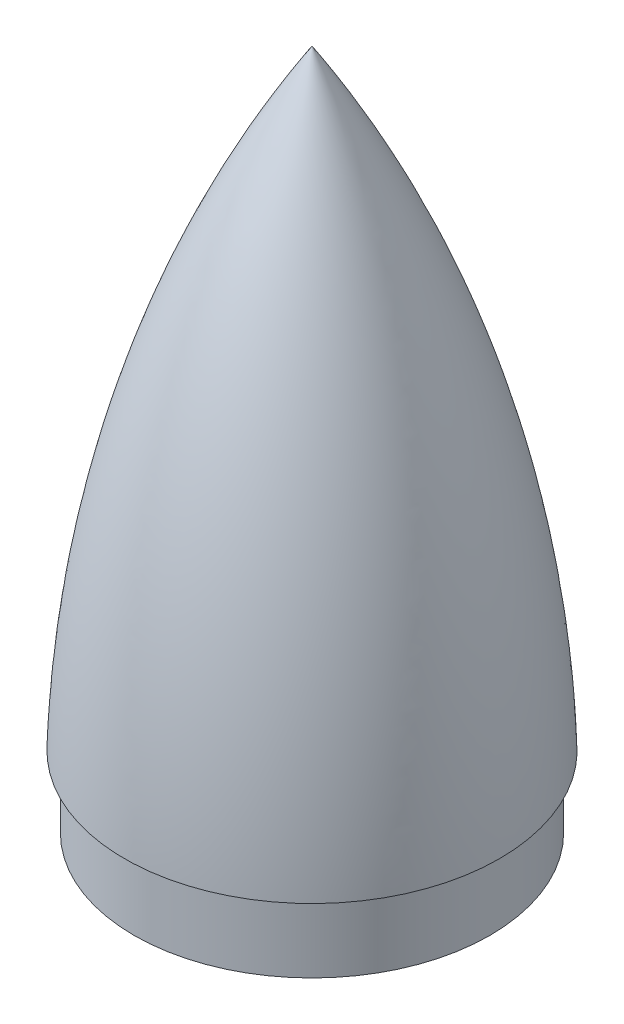
ISO-10303-21;
HEADER;
FILE_DESCRIPTION(('STEP AP214'),'2;1');
FILE_NAME('part.step','',(''),(''),'','','');
FILE_SCHEMA(('AUTOMOTIVE_DESIGN { 1 0 10303 214 1 1 1 1 }'));
ENDSEC;
DATA;
#1=APPLICATION_CONTEXT('core data for automotive mechanical design processes');
#2=APPLICATION_PROTOCOL_DEFINITION('international standard','automotive_design',2000,#1);
#3=PRODUCT_CONTEXT('',#1,'mechanical');
#4=PRODUCT('Part','Part','',(#3));
#5=PRODUCT_RELATED_PRODUCT_CATEGORY('part','',(#4));
#6=PRODUCT_DEFINITION_FORMATION('','',#4);
#7=PRODUCT_DEFINITION_CONTEXT('part definition',#1,'design');
#8=PRODUCT_DEFINITION('design','',#6,#7);
#9=PRODUCT_DEFINITION_SHAPE('','',#8);
#10=(LENGTH_UNIT() NAMED_UNIT(*) SI_UNIT(.MILLI.,.METRE.));
#11=(NAMED_UNIT(*) PLANE_ANGLE_UNIT() SI_UNIT($,.RADIAN.));
#12=(NAMED_UNIT(*) SI_UNIT($,.STERADIAN.) SOLID_ANGLE_UNIT());
#13=UNCERTAINTY_MEASURE_WITH_UNIT(LENGTH_MEASURE(1.E-05),#10,'distance_accuracy_value','');
#14=(GEOMETRIC_REPRESENTATION_CONTEXT(3) GLOBAL_UNCERTAINTY_ASSIGNED_CONTEXT((#13)) GLOBAL_UNIT_ASSIGNED_CONTEXT((#10,
#11,#12)) REPRESENTATION_CONTEXT('',''));
#15=CARTESIAN_POINT('',(0.,0.,0.));
#16=DIRECTION('',(0.,0.,1.));
#17=DIRECTION('',(1.,0.,0.));
#18=AXIS2_PLACEMENT_3D('',#15,#16,#17);
#19=CARTESIAN_POINT('',(-1.04516256426433E-13,-35.56,0.));
#20=DIRECTION('',(0.,-1.,0.));
#21=DIRECTION('',(1.,0.,0.));
#22=AXIS2_PLACEMENT_3D('',#19,#20,#21);
#23=PLANE('',#22);
#24=CARTESIAN_POINT('',(-1.04516256426433E-13,-35.56,0.));
#25=DIRECTION('',(0.,-1.,0.));
#26=DIRECTION('',(1.,0.,0.));
#27=AXIS2_PLACEMENT_3D('',#24,#25,#26);
#28=CIRCLE('',#27,88.9);
#29=CARTESIAN_POINT('',(88.8999999999999,-35.5600000000003,0.));
#30=VERTEX_POINT('',#29);
#31=EDGE_CURVE('E11',#30,#30,#28,.T.);
#32=ORIENTED_EDGE('',*,*,#31,.T.);
#33=EDGE_LOOP('',(#32));
#34=FACE_BOUND('',#33,.T.);
#35=CARTESIAN_POINT('',(-1.04516256426433E-13,-35.56,0.));
#36=DIRECTION('',(0.,-1.,0.));
#37=DIRECTION('',(1.,0.,0.));
#38=AXIS2_PLACEMENT_3D('',#35,#36,#37);
#39=CIRCLE('',#38,86.995);
#40=CARTESIAN_POINT('',(86.9949999999999,-35.5600000000003,0.));
#41=VERTEX_POINT('',#40);
#42=EDGE_CURVE('E53',#41,#41,#39,.T.);
#43=ORIENTED_EDGE('',*,*,#42,.F.);
#44=EDGE_LOOP('',(#43));
#45=FACE_BOUND('',#44,.T.);
#46=ADVANCED_FACE('F42',(#34,#45),#23,.T.);
#47=CARTESIAN_POINT('',(0.,0.,0.));
#48=DIRECTION('',(0.,-1.,0.));
#49=DIRECTION('',(1.,0.,0.));
#50=AXIS2_PLACEMENT_3D('',#47,#48,#49);
#51=PLANE('',#50);
#52=CARTESIAN_POINT('',(0.,0.,0.));
#53=DIRECTION('',(0.,-1.,0.));
#54=DIRECTION('',(1.,0.,0.));
#55=AXIS2_PLACEMENT_3D('',#52,#53,#54);
#56=CIRCLE('',#55,88.9);
#57=CARTESIAN_POINT('',(88.9,-2.61290641066084E-13,0.));
#58=VERTEX_POINT('',#57);
#59=EDGE_CURVE('E46',#58,#58,#56,.T.);
#60=ORIENTED_EDGE('',*,*,#59,.F.);
#61=EDGE_LOOP('',(#60));
#62=FACE_BOUND('',#61,.T.);
#63=CARTESIAN_POINT('',(0.,0.,0.));
#64=DIRECTION('',(0.,-1.,0.));
#65=DIRECTION('',(1.,0.,0.));
#66=AXIS2_PLACEMENT_3D('',#63,#64,#65);
#67=CIRCLE('',#66,86.995);
#68=CARTESIAN_POINT('',(86.995,-2.55691555900382E-13,0.));
#69=VERTEX_POINT('',#68);
#70=EDGE_CURVE('E55',#69,#69,#67,.T.);
#71=ORIENTED_EDGE('',*,*,#70,.T.);
#72=EDGE_LOOP('',(#71));
#73=FACE_BOUND('',#72,.T.);
#74=ADVANCED_FACE('F65',(#62,#73),#51,.F.);
#75=CARTESIAN_POINT('',(-1.04516256426433E-13,-35.56,0.));
#76=DIRECTION('',(0.,1.,0.));
#77=DIRECTION('',(-1.,0.,0.));
#78=AXIS2_PLACEMENT_3D('',#75,#76,#77);
#79=CYLINDRICAL_SURFACE('',#78,88.9);
#80=ORIENTED_EDGE('',*,*,#31,.F.);
#81=EDGE_LOOP('',(#80));
#82=FACE_BOUND('',#81,.T.);
#83=ORIENTED_EDGE('',*,*,#59,.T.);
#84=EDGE_LOOP('',(#83));
#85=FACE_BOUND('',#84,.T.);
#86=ADVANCED_FACE('F44',(#82,#85),#79,.T.);
#87=CARTESIAN_POINT('',(-1.04516256426433E-13,-35.56,0.));
#88=DIRECTION('',(0.,1.,0.));
#89=DIRECTION('',(-1.,0.,0.));
#90=AXIS2_PLACEMENT_3D('',#87,#88,#89);
#91=CYLINDRICAL_SURFACE('',#90,86.995);
#92=ORIENTED_EDGE('',*,*,#42,.T.);
#93=EDGE_LOOP('',(#92));
#94=FACE_BOUND('',#93,.T.);
#95=ORIENTED_EDGE('',*,*,#70,.F.);
#96=EDGE_LOOP('',(#95));
#97=FACE_BOUND('',#96,.T.);
#98=ADVANCED_FACE('F61',(#94,#97),#91,.F.);
#99=CLOSED_SHELL('',(#46,#74,#86,#98));
#100=MANIFOLD_SOLID_BREP('B2',#99);
#101=CARTESIAN_POINT('',(507.568702971262,-17.9374345129202,0.));
#102=DIRECTION('',(0.,0.,-1.));
#103=DIRECTION('',(-1.,0.,0.));
#104=AXIS2_PLACEMENT_3D('',#101,#102,#103);
#105=CIRCLE('',#104,601.486026331378);
#106=TRIMMED_CURVE('',#105,(PARAMETER_VALUE(-0.566363368481628)),
(PARAMETER_VALUE(0.566363368481628)),.T.,.PARAMETER.);
#107=CARTESIAN_POINT('',(-9.99200722162641E-13,-17.9374345129187,0.));
#108=DIRECTION('',(0.,1.,0.));
#109=AXIS1_PLACEMENT('',#107,#108);
#110=SURFACE_OF_REVOLUTION('',#106,#109);
#111=CARTESIAN_POINT('',(-8.95853626512287E-13,-2.77555756156289E-13,0.));
#112=DIRECTION('',(0.,1.,0.));
#113=DIRECTION('',(-1.,0.,0.));
#114=AXIS2_PLACEMENT_3D('',#111,#112,#113);
#115=CIRCLE('',#114,93.6497999999991);
#116=CARTESIAN_POINT('',(-93.6498,0.,0.));
#117=VERTEX_POINT('',#116);
#118=EDGE_CURVE('E40',#117,#117,#115,.T.);
#119=ORIENTED_EDGE('',*,*,#118,.T.);
#120=EDGE_LOOP('',(#119));
#121=FACE_BOUND('',#120,.T.);
#122=CARTESIAN_POINT('',(0.,304.8,0.));
#123=VERTEX_POINT('',#122);
#124=VERTEX_LOOP('',#123);
#125=FACE_BOUND('',#124,.T.);
#126=ADVANCED_FACE('F103',(#121,#125),#110,.T.);
#127=CARTESIAN_POINT('',(-93.6498,0.,0.));
#128=DIRECTION('',(0.,-1.,0.));
#129=DIRECTION('',(1.,0.,0.));
#130=AXIS2_PLACEMENT_3D('',#127,#128,#129);
#131=PLANE('',#130);
#132=CARTESIAN_POINT('',(-8.95853626512287E-13,-2.22044604925031E-13,0.));
#133=DIRECTION('',(0.,1.,0.));
#134=DIRECTION('',(-1.,0.,0.));
#135=AXIS2_PLACEMENT_3D('',#132,#133,#134);
#136=CIRCLE('',#135,88.8999999999991);
#137=CARTESIAN_POINT('',(-88.9,0.,0.));
#138=VERTEX_POINT('',#137);
#139=EDGE_CURVE('E110',#138,#138,#136,.T.);
#140=ORIENTED_EDGE('',*,*,#139,.T.);
#141=EDGE_LOOP('',(#140));
#142=FACE_BOUND('',#141,.T.);
#143=ORIENTED_EDGE('',*,*,#118,.F.);
#144=EDGE_LOOP('',(#143));
#145=FACE_BOUND('',#144,.T.);
#146=ADVANCED_FACE('F119',(#142,#145),#131,.T.);
#147=CARTESIAN_POINT('',(553.247806952805,-27.4232478249846,0.));
#148=DIRECTION('',(0.,0.,-1.));
#149=DIRECTION('',(-1.,0.,0.));
#150=AXIS2_PLACEMENT_3D('',#147,#148,#149);
#151=CIRCLE('',#150,642.733102069255);
#152=TRIMMED_CURVE('',#151,(PARAMETER_VALUE(-0.534008354046208)),
(PARAMETER_VALUE(0.534008354046208)),.T.,.PARAMETER.);
#153=CARTESIAN_POINT('',(-9.99200722162641E-13,-27.423247824983,0.));
#154=DIRECTION('',(0.,1.,0.));
#155=AXIS1_PLACEMENT('',#153,#154);
#156=SURFACE_OF_REVOLUTION('',#152,#155);
#157=CARTESIAN_POINT('',(0.,299.72,0.));
#158=VERTEX_POINT('',#157);
#159=VERTEX_LOOP('',#158);
#160=FACE_BOUND('',#159,.T.);
#161=ORIENTED_EDGE('',*,*,#139,.F.);
#162=EDGE_LOOP('',(#161));
#163=FACE_BOUND('',#162,.T.);
#164=ADVANCED_FACE('F116',(#160,#163),#156,.F.);
#165=CLOSED_SHELL('',(#126,#146,#164));
#166=MANIFOLD_SOLID_BREP('B6',#165);
#167=ADVANCED_BREP_SHAPE_REPRESENTATION('',(#18,#100,#166),#14);
#168=SHAPE_DEFINITION_REPRESENTATION(#9,#167);
ENDSEC;
END-ISO-10303-21;
